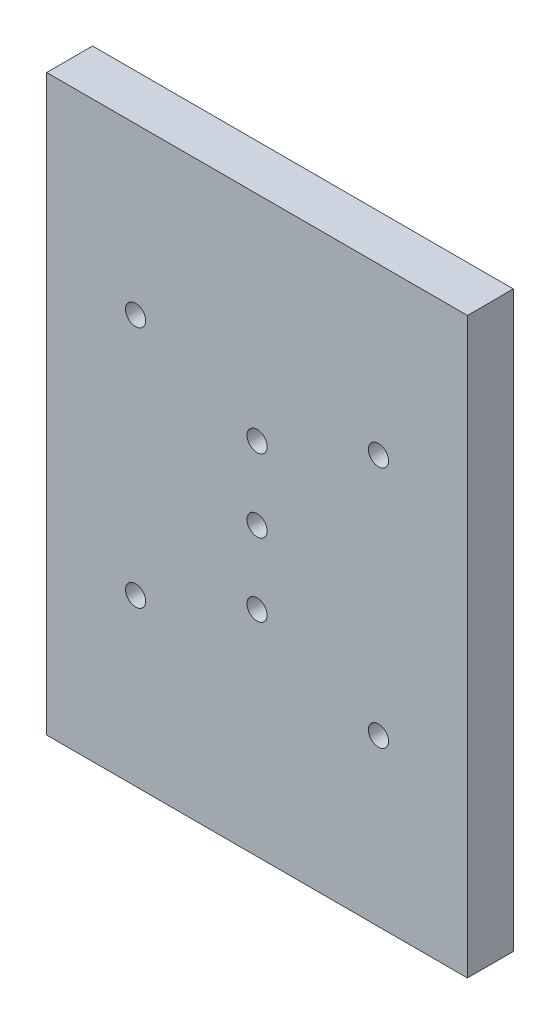
ISO-10303-21;
HEADER;
FILE_DESCRIPTION(('STEP AP214'),'2;1');
FILE_NAME('part.step','',(''),(''),'','','');
FILE_SCHEMA(('AUTOMOTIVE_DESIGN { 1 0 10303 214 1 1 1 1 }'));
ENDSEC;
DATA;
#1=APPLICATION_CONTEXT('core data for automotive mechanical design processes');
#2=APPLICATION_PROTOCOL_DEFINITION('international standard','automotive_design',2000,#1);
#3=PRODUCT_CONTEXT('',#1,'mechanical');
#4=PRODUCT('Part','Part','',(#3));
#5=PRODUCT_RELATED_PRODUCT_CATEGORY('part','',(#4));
#6=PRODUCT_DEFINITION_FORMATION('','',#4);
#7=PRODUCT_DEFINITION_CONTEXT('part definition',#1,'design');
#8=PRODUCT_DEFINITION('design','',#6,#7);
#9=PRODUCT_DEFINITION_SHAPE('','',#8);
#10=(LENGTH_UNIT() NAMED_UNIT(*) SI_UNIT(.MILLI.,.METRE.));
#11=(NAMED_UNIT(*) PLANE_ANGLE_UNIT() SI_UNIT($,.RADIAN.));
#12=(NAMED_UNIT(*) SI_UNIT($,.STERADIAN.) SOLID_ANGLE_UNIT());
#13=UNCERTAINTY_MEASURE_WITH_UNIT(LENGTH_MEASURE(1.E-05),#10,'distance_accuracy_value','');
#14=(GEOMETRIC_REPRESENTATION_CONTEXT(3) GLOBAL_UNCERTAINTY_ASSIGNED_CONTEXT((#13)) GLOBAL_UNIT_ASSIGNED_CONTEXT((#10,
#11,#12)) REPRESENTATION_CONTEXT('',''));
#15=CARTESIAN_POINT('',(0.,0.,0.));
#16=DIRECTION('',(0.,0.,1.));
#17=DIRECTION('',(1.,0.,0.));
#18=AXIS2_PLACEMENT_3D('',#15,#16,#17);
#19=CARTESIAN_POINT('',(-11.6249999999999,-53.3750000000001,6.));
#20=DIRECTION('',(0.,0.,-1.));
#21=DIRECTION('',(-1.,0.,0.));
#22=AXIS2_PLACEMENT_3D('',#19,#20,#21);
#23=CYLINDRICAL_SURFACE('',#22,1.32);
#24=CARTESIAN_POINT('',(-11.6249999999999,-53.3750000000001,6.));
#25=DIRECTION('',(0.,0.,1.));
#26=DIRECTION('',(1.,0.,0.));
#27=AXIS2_PLACEMENT_3D('',#24,#25,#26);
#28=CIRCLE('',#27,1.32);
#29=CARTESIAN_POINT('',(-10.3049999999999,-53.3750000000001,6.));
#30=VERTEX_POINT('',#29);
#31=EDGE_CURVE('E160',#30,#30,#28,.T.);
#32=ORIENTED_EDGE('',*,*,#31,.T.);
#33=EDGE_LOOP('',(#32));
#34=FACE_BOUND('',#33,.T.);
#35=CARTESIAN_POINT('',(-11.6249999999999,-53.3750000000001,4.));
#36=DIRECTION('',(0.,0.,-1.));
#37=DIRECTION('',(-1.,0.,0.));
#38=AXIS2_PLACEMENT_3D('',#35,#36,#37);
#39=CIRCLE('',#38,1.32);
#40=CARTESIAN_POINT('',(-12.9449999999999,-53.3750000000001,4.));
#41=VERTEX_POINT('',#40);
#42=EDGE_CURVE('E39',#41,#41,#39,.T.);
#43=ORIENTED_EDGE('',*,*,#42,.T.);
#44=EDGE_LOOP('',(#43));
#45=FACE_BOUND('',#44,.T.);
#46=ADVANCED_FACE('F35',(#34,#45),#23,.F.);
#47=CARTESIAN_POINT('',(-43.3750000000002,-53.3750000000001,6.));
#48=DIRECTION('',(0.,0.,-1.));
#49=DIRECTION('',(-1.,0.,0.));
#50=AXIS2_PLACEMENT_3D('',#47,#48,#49);
#51=CYLINDRICAL_SURFACE('',#50,1.32);
#52=CARTESIAN_POINT('',(-43.3750000000002,-53.3750000000001,6.));
#53=DIRECTION('',(0.,0.,1.));
#54=DIRECTION('',(1.,0.,0.));
#55=AXIS2_PLACEMENT_3D('',#52,#53,#54);
#56=CIRCLE('',#55,1.32);
#57=CARTESIAN_POINT('',(-42.0550000000002,-53.3750000000001,6.));
#58=VERTEX_POINT('',#57);
#59=EDGE_CURVE('E155',#58,#58,#56,.T.);
#60=ORIENTED_EDGE('',*,*,#59,.T.);
#61=EDGE_LOOP('',(#60));
#62=FACE_BOUND('',#61,.T.);
#63=CARTESIAN_POINT('',(-43.3750000000002,-53.3750000000001,4.));
#64=DIRECTION('',(0.,0.,-1.));
#65=DIRECTION('',(-1.,0.,0.));
#66=AXIS2_PLACEMENT_3D('',#63,#64,#65);
#67=CIRCLE('',#66,1.32);
#68=CARTESIAN_POINT('',(-44.6950000000002,-53.3750000000001,4.));
#69=VERTEX_POINT('',#68);
#70=EDGE_CURVE('E121',#69,#69,#67,.T.);
#71=ORIENTED_EDGE('',*,*,#70,.T.);
#72=EDGE_LOOP('',(#71));
#73=FACE_BOUND('',#72,.T.);
#74=ADVANCED_FACE('F208',(#62,#73),#51,.F.);
#75=CARTESIAN_POINT('',(-43.3750000000002,-21.6250000000001,6.));
#76=DIRECTION('',(0.,0.,-1.));
#77=DIRECTION('',(-1.,0.,0.));
#78=AXIS2_PLACEMENT_3D('',#75,#76,#77);
#79=CYLINDRICAL_SURFACE('',#78,1.32);
#80=CARTESIAN_POINT('',(-43.3750000000002,-21.6250000000001,6.));
#81=DIRECTION('',(0.,0.,1.));
#82=DIRECTION('',(1.,0.,0.));
#83=AXIS2_PLACEMENT_3D('',#80,#81,#82);
#84=CIRCLE('',#83,1.32);
#85=CARTESIAN_POINT('',(-42.0550000000002,-21.6250000000001,6.));
#86=VERTEX_POINT('',#85);
#87=EDGE_CURVE('E106',#86,#86,#84,.T.);
#88=ORIENTED_EDGE('',*,*,#87,.T.);
#89=EDGE_LOOP('',(#88));
#90=FACE_BOUND('',#89,.T.);
#91=CARTESIAN_POINT('',(-43.3750000000002,-21.6250000000001,4.));
#92=DIRECTION('',(0.,0.,-1.));
#93=DIRECTION('',(-1.,0.,0.));
#94=AXIS2_PLACEMENT_3D('',#91,#92,#93);
#95=CIRCLE('',#94,1.32);
#96=CARTESIAN_POINT('',(-44.6950000000002,-21.6250000000001,4.));
#97=VERTEX_POINT('',#96);
#98=EDGE_CURVE('E117',#97,#97,#95,.T.);
#99=ORIENTED_EDGE('',*,*,#98,.T.);
#100=EDGE_LOOP('',(#99));
#101=FACE_BOUND('',#100,.T.);
#102=ADVANCED_FACE('F175',(#90,#101),#79,.F.);
#103=CARTESIAN_POINT('',(-11.6250000000002,-21.6250000000001,6.));
#104=DIRECTION('',(0.,0.,-1.));
#105=DIRECTION('',(-1.,0.,0.));
#106=AXIS2_PLACEMENT_3D('',#103,#104,#105);
#107=CYLINDRICAL_SURFACE('',#106,1.32);
#108=CARTESIAN_POINT('',(-11.6250000000002,-21.6250000000001,6.));
#109=DIRECTION('',(0.,0.,1.));
#110=DIRECTION('',(1.,0.,0.));
#111=AXIS2_PLACEMENT_3D('',#108,#109,#110);
#112=CIRCLE('',#111,1.32);
#113=CARTESIAN_POINT('',(-10.3050000000002,-21.6250000000001,6.));
#114=VERTEX_POINT('',#113);
#115=EDGE_CURVE('E163',#114,#114,#112,.T.);
#116=ORIENTED_EDGE('',*,*,#115,.T.);
#117=EDGE_LOOP('',(#116));
#118=FACE_BOUND('',#117,.T.);
#119=CARTESIAN_POINT('',(-11.6250000000002,-21.6250000000001,4.));
#120=DIRECTION('',(0.,0.,-1.));
#121=DIRECTION('',(-1.,0.,0.));
#122=AXIS2_PLACEMENT_3D('',#119,#120,#121);
#123=CIRCLE('',#122,1.32);
#124=CARTESIAN_POINT('',(-12.9450000000002,-21.6250000000001,4.));
#125=VERTEX_POINT('',#124);
#126=EDGE_CURVE('E112',#125,#125,#123,.T.);
#127=ORIENTED_EDGE('',*,*,#126,.T.);
#128=EDGE_LOOP('',(#127));
#129=FACE_BOUND('',#128,.T.);
#130=ADVANCED_FACE('F180',(#118,#129),#107,.F.);
#131=CARTESIAN_POINT('',(0.,0.,6.));
#132=DIRECTION('',(0.,0.,-1.));
#133=DIRECTION('',(-1.,0.,0.));
#134=AXIS2_PLACEMENT_3D('',#131,#132,#133);
#135=PLANE('',#134);
#136=CARTESIAN_POINT('',(-27.5,-37.5,6.));
#137=DIRECTION('',(0.,0.,1.));
#138=DIRECTION('',(1.,0.,0.));
#139=AXIS2_PLACEMENT_3D('',#136,#137,#138);
#140=CIRCLE('',#139,1.32);
#141=CARTESIAN_POINT('',(-26.18,-37.5,6.));
#142=VERTEX_POINT('',#141);
#143=EDGE_CURVE('E152',#142,#142,#140,.T.);
#144=ORIENTED_EDGE('',*,*,#143,.F.);
#145=EDGE_LOOP('',(#144));
#146=FACE_BOUND('',#145,.T.);
#147=ORIENTED_EDGE('',*,*,#31,.F.);
#148=EDGE_LOOP('',(#147));
#149=FACE_BOUND('',#148,.T.);
#150=CARTESIAN_POINT('',(-27.5,-27.97,6.));
#151=DIRECTION('',(0.,0.,1.));
#152=DIRECTION('',(1.,0.,0.));
#153=AXIS2_PLACEMENT_3D('',#150,#151,#152);
#154=CIRCLE('',#153,1.32);
#155=CARTESIAN_POINT('',(-26.18,-27.97,6.));
#156=VERTEX_POINT('',#155);
#157=EDGE_CURVE('E167',#156,#156,#154,.T.);
#158=ORIENTED_EDGE('',*,*,#157,.F.);
#159=EDGE_LOOP('',(#158));
#160=FACE_BOUND('',#159,.T.);
#161=DIRECTION('',(0.,1.,0.));
#162=VECTOR('',#161,1.);
#163=CARTESIAN_POINT('',(0.,0.,6.));
#164=LINE('',#163,#162);
#165=CARTESIAN_POINT('',(0.,-75.,6.));
#166=VERTEX_POINT('',#165);
#167=CARTESIAN_POINT('',(0.,0.,6.));
#168=VERTEX_POINT('',#167);
#169=EDGE_CURVE('E90',#166,#168,#164,.T.);
#170=ORIENTED_EDGE('',*,*,#169,.T.);
#171=DIRECTION('',(-1.,0.,0.));
#172=VECTOR('',#171,1.);
#173=CARTESIAN_POINT('',(0.,0.,6.));
#174=LINE('',#173,#172);
#175=CARTESIAN_POINT('',(-55.,0.,6.));
#176=VERTEX_POINT('',#175);
#177=EDGE_CURVE('E84',#168,#176,#174,.T.);
#178=ORIENTED_EDGE('',*,*,#177,.T.);
#179=DIRECTION('',(0.,-1.,0.));
#180=VECTOR('',#179,1.);
#181=CARTESIAN_POINT('',(-55.,0.,6.));
#182=LINE('',#181,#180);
#183=CARTESIAN_POINT('',(-55.,-75.,6.));
#184=VERTEX_POINT('',#183);
#185=EDGE_CURVE('E88',#176,#184,#182,.T.);
#186=ORIENTED_EDGE('',*,*,#185,.T.);
#187=DIRECTION('',(1.,0.,0.));
#188=VECTOR('',#187,1.);
#189=CARTESIAN_POINT('',(0.,-75.,6.));
#190=LINE('',#189,#188);
#191=EDGE_CURVE('E54',#184,#166,#190,.T.);
#192=ORIENTED_EDGE('',*,*,#191,.T.);
#193=EDGE_LOOP('',(#170,#178,#186,#192));
#194=FACE_BOUND('',#193,.T.);
#195=ORIENTED_EDGE('',*,*,#87,.F.);
#196=EDGE_LOOP('',(#195));
#197=FACE_BOUND('',#196,.T.);
#198=ORIENTED_EDGE('',*,*,#115,.F.);
#199=EDGE_LOOP('',(#198));
#200=FACE_BOUND('',#199,.T.);
#201=ORIENTED_EDGE('',*,*,#59,.F.);
#202=EDGE_LOOP('',(#201));
#203=FACE_BOUND('',#202,.T.);
#204=CARTESIAN_POINT('',(-27.5,-47.03,6.));
#205=DIRECTION('',(0.,0.,1.));
#206=DIRECTION('',(1.,0.,0.));
#207=AXIS2_PLACEMENT_3D('',#204,#205,#206);
#208=CIRCLE('',#207,1.32);
#209=CARTESIAN_POINT('',(-26.18,-47.03,6.));
#210=VERTEX_POINT('',#209);
#211=EDGE_CURVE('E146',#210,#210,#208,.T.);
#212=ORIENTED_EDGE('',*,*,#211,.F.);
#213=EDGE_LOOP('',(#212));
#214=FACE_BOUND('',#213,.T.);
#215=ADVANCED_FACE('F85',(#146,#149,#160,#194,#197,#200,#203,#214),#135,.F.);
#216=CARTESIAN_POINT('',(0.,0.,0.));
#217=DIRECTION('',(0.,0.,-1.));
#218=DIRECTION('',(-1.,0.,0.));
#219=AXIS2_PLACEMENT_3D('',#216,#217,#218);
#220=PLANE('',#219);
#221=CARTESIAN_POINT('',(-11.6250000000006,-53.3750000000001,0.));
#222=DIRECTION('',(0.,0.,-1.));
#223=DIRECTION('',(-1.,0.,0.));
#224=AXIS2_PLACEMENT_3D('',#221,#222,#223);
#225=CIRCLE('',#224,3.25);
#226=CARTESIAN_POINT('',(-14.8750000000006,-53.3750000000001,0.));
#227=VERTEX_POINT('',#226);
#228=EDGE_CURVE('E137',#227,#227,#225,.T.);
#229=ORIENTED_EDGE('',*,*,#228,.F.);
#230=EDGE_LOOP('',(#229));
#231=FACE_BOUND('',#230,.T.);
#232=CARTESIAN_POINT('',(-43.3750000000006,-53.3750000000001,0.));
#233=DIRECTION('',(0.,0.,-1.));
#234=DIRECTION('',(-1.,0.,0.));
#235=AXIS2_PLACEMENT_3D('',#232,#233,#234);
#236=CIRCLE('',#235,3.25000000000001);
#237=CARTESIAN_POINT('',(-46.6250000000006,-53.3750000000001,0.));
#238=VERTEX_POINT('',#237);
#239=EDGE_CURVE('E130',#238,#238,#236,.T.);
#240=ORIENTED_EDGE('',*,*,#239,.F.);
#241=EDGE_LOOP('',(#240));
#242=FACE_BOUND('',#241,.T.);
#243=CARTESIAN_POINT('',(-43.3750000000002,-21.6250000000001,0.));
#244=DIRECTION('',(0.,0.,-1.));
#245=DIRECTION('',(-1.,0.,0.));
#246=AXIS2_PLACEMENT_3D('',#243,#244,#245);
#247=CIRCLE('',#246,3.25000000000001);
#248=CARTESIAN_POINT('',(-46.6250000000002,-21.6250000000001,0.));
#249=VERTEX_POINT('',#248);
#250=EDGE_CURVE('E123',#249,#249,#247,.T.);
#251=ORIENTED_EDGE('',*,*,#250,.F.);
#252=EDGE_LOOP('',(#251));
#253=FACE_BOUND('',#252,.T.);
#254=CARTESIAN_POINT('',(-11.6250000000002,-21.6250000000001,0.));
#255=DIRECTION('',(0.,0.,-1.));
#256=DIRECTION('',(-1.,0.,0.));
#257=AXIS2_PLACEMENT_3D('',#254,#255,#256);
#258=CIRCLE('',#257,3.25);
#259=CARTESIAN_POINT('',(-14.8750000000002,-21.6250000000001,0.));
#260=VERTEX_POINT('',#259);
#261=EDGE_CURVE('E119',#260,#260,#258,.T.);
#262=ORIENTED_EDGE('',*,*,#261,.F.);
#263=EDGE_LOOP('',(#262));
#264=FACE_BOUND('',#263,.T.);
#265=CARTESIAN_POINT('',(-27.5,-37.5,0.));
#266=DIRECTION('',(0.,0.,1.));
#267=DIRECTION('',(1.,0.,0.));
#268=AXIS2_PLACEMENT_3D('',#265,#266,#267);
#269=CIRCLE('',#268,1.32);
#270=CARTESIAN_POINT('',(-26.18,-37.5,0.));
#271=VERTEX_POINT('',#270);
#272=EDGE_CURVE('E149',#271,#271,#269,.T.);
#273=ORIENTED_EDGE('',*,*,#272,.T.);
#274=EDGE_LOOP('',(#273));
#275=FACE_BOUND('',#274,.T.);
#276=CARTESIAN_POINT('',(-27.5,-27.97,0.));
#277=DIRECTION('',(0.,0.,1.));
#278=DIRECTION('',(1.,0.,0.));
#279=AXIS2_PLACEMENT_3D('',#276,#277,#278);
#280=CIRCLE('',#279,1.32);
#281=CARTESIAN_POINT('',(-26.18,-27.97,0.));
#282=VERTEX_POINT('',#281);
#283=EDGE_CURVE('E166',#282,#282,#280,.T.);
#284=ORIENTED_EDGE('',*,*,#283,.T.);
#285=EDGE_LOOP('',(#284));
#286=FACE_BOUND('',#285,.T.);
#287=DIRECTION('',(0.,1.,0.));
#288=VECTOR('',#287,1.);
#289=CARTESIAN_POINT('',(0.,0.,0.));
#290=LINE('',#289,#288);
#291=CARTESIAN_POINT('',(0.,-75.,0.));
#292=VERTEX_POINT('',#291);
#293=CARTESIAN_POINT('',(0.,0.,0.));
#294=VERTEX_POINT('',#293);
#295=EDGE_CURVE('E103',#292,#294,#290,.T.);
#296=ORIENTED_EDGE('',*,*,#295,.F.);
#297=DIRECTION('',(1.,0.,0.));
#298=VECTOR('',#297,1.);
#299=CARTESIAN_POINT('',(0.,-75.,0.));
#300=LINE('',#299,#298);
#301=CARTESIAN_POINT('',(-55.,-75.,0.));
#302=VERTEX_POINT('',#301);
#303=EDGE_CURVE('E77',#302,#292,#300,.T.);
#304=ORIENTED_EDGE('',*,*,#303,.F.);
#305=DIRECTION('',(0.,-1.,0.));
#306=VECTOR('',#305,1.);
#307=CARTESIAN_POINT('',(-55.,0.,0.));
#308=LINE('',#307,#306);
#309=CARTESIAN_POINT('',(-55.,0.,0.));
#310=VERTEX_POINT('',#309);
#311=EDGE_CURVE('E71',#310,#302,#308,.T.);
#312=ORIENTED_EDGE('',*,*,#311,.F.);
#313=DIRECTION('',(-1.,0.,0.));
#314=VECTOR('',#313,1.);
#315=CARTESIAN_POINT('',(0.,0.,0.));
#316=LINE('',#315,#314);
#317=EDGE_CURVE('E94',#294,#310,#316,.T.);
#318=ORIENTED_EDGE('',*,*,#317,.F.);
#319=EDGE_LOOP('',(#296,#304,#312,#318));
#320=FACE_BOUND('',#319,.T.);
#321=CARTESIAN_POINT('',(-27.5,-47.03,0.));
#322=DIRECTION('',(0.,0.,1.));
#323=DIRECTION('',(1.,0.,0.));
#324=AXIS2_PLACEMENT_3D('',#321,#322,#323);
#325=CIRCLE('',#324,1.32);
#326=CARTESIAN_POINT('',(-26.18,-47.03,0.));
#327=VERTEX_POINT('',#326);
#328=EDGE_CURVE('E115',#327,#327,#325,.T.);
#329=ORIENTED_EDGE('',*,*,#328,.T.);
#330=EDGE_LOOP('',(#329));
#331=FACE_BOUND('',#330,.T.);
#332=ADVANCED_FACE('F179',(#231,#242,#253,#264,#275,#286,#320,#331),#220,.T.);
#333=CARTESIAN_POINT('',(0.,0.,6.));
#334=DIRECTION('',(-1.,0.,0.));
#335=DIRECTION('',(0.,-1.,0.));
#336=AXIS2_PLACEMENT_3D('',#333,#334,#335);
#337=PLANE('',#336);
#338=ORIENTED_EDGE('',*,*,#295,.T.);
#339=DIRECTION('',(0.,0.,-1.));
#340=VECTOR('',#339,1.);
#341=CARTESIAN_POINT('',(0.,0.,6.));
#342=LINE('',#341,#340);
#343=EDGE_CURVE('E11',#168,#294,#342,.T.);
#344=ORIENTED_EDGE('',*,*,#343,.F.);
#345=ORIENTED_EDGE('',*,*,#169,.F.);
#346=DIRECTION('',(0.,0.,-1.));
#347=VECTOR('',#346,1.);
#348=CARTESIAN_POINT('',(0.,-75.,6.));
#349=LINE('',#348,#347);
#350=EDGE_CURVE('E99',#166,#292,#349,.T.);
#351=ORIENTED_EDGE('',*,*,#350,.T.);
#352=EDGE_LOOP('',(#338,#344,#345,#351));
#353=FACE_BOUND('',#352,.T.);
#354=ADVANCED_FACE('F37',(#353),#337,.F.);
#355=CARTESIAN_POINT('',(0.,0.,6.));
#356=DIRECTION('',(0.,-1.,0.));
#357=DIRECTION('',(1.,0.,0.));
#358=AXIS2_PLACEMENT_3D('',#355,#356,#357);
#359=PLANE('',#358);
#360=ORIENTED_EDGE('',*,*,#317,.T.);
#361=DIRECTION('',(0.,0.,-1.));
#362=VECTOR('',#361,1.);
#363=CARTESIAN_POINT('',(-55.,0.,6.));
#364=LINE('',#363,#362);
#365=EDGE_CURVE('E45',#176,#310,#364,.T.);
#366=ORIENTED_EDGE('',*,*,#365,.F.);
#367=ORIENTED_EDGE('',*,*,#177,.F.);
#368=ORIENTED_EDGE('',*,*,#343,.T.);
#369=EDGE_LOOP('',(#360,#366,#367,#368));
#370=FACE_BOUND('',#369,.T.);
#371=ADVANCED_FACE('F93',(#370),#359,.F.);
#372=CARTESIAN_POINT('',(-55.,0.,6.));
#373=DIRECTION('',(1.,0.,0.));
#374=DIRECTION('',(0.,1.,0.));
#375=AXIS2_PLACEMENT_3D('',#372,#373,#374);
#376=PLANE('',#375);
#377=ORIENTED_EDGE('',*,*,#311,.T.);
#378=DIRECTION('',(0.,0.,-1.));
#379=VECTOR('',#378,1.);
#380=CARTESIAN_POINT('',(-55.,-75.,6.));
#381=LINE('',#380,#379);
#382=EDGE_CURVE('E95',#184,#302,#381,.T.);
#383=ORIENTED_EDGE('',*,*,#382,.F.);
#384=ORIENTED_EDGE('',*,*,#185,.F.);
#385=ORIENTED_EDGE('',*,*,#365,.T.);
#386=EDGE_LOOP('',(#377,#383,#384,#385));
#387=FACE_BOUND('',#386,.T.);
#388=ADVANCED_FACE('F97',(#387),#376,.F.);
#389=CARTESIAN_POINT('',(0.,-75.,6.));
#390=DIRECTION('',(0.,1.,0.));
#391=DIRECTION('',(-1.,0.,0.));
#392=AXIS2_PLACEMENT_3D('',#389,#390,#391);
#393=PLANE('',#392);
#394=ORIENTED_EDGE('',*,*,#303,.T.);
#395=ORIENTED_EDGE('',*,*,#350,.F.);
#396=ORIENTED_EDGE('',*,*,#191,.F.);
#397=ORIENTED_EDGE('',*,*,#382,.T.);
#398=EDGE_LOOP('',(#394,#395,#396,#397));
#399=FACE_BOUND('',#398,.T.);
#400=ADVANCED_FACE('F225',(#399),#393,.F.);
#401=CARTESIAN_POINT('',(-27.5,-27.97,6.));
#402=DIRECTION('',(0.,0.,-1.));
#403=DIRECTION('',(-1.,0.,0.));
#404=AXIS2_PLACEMENT_3D('',#401,#402,#403);
#405=CYLINDRICAL_SURFACE('',#404,1.32);
#406=ORIENTED_EDGE('',*,*,#157,.T.);
#407=EDGE_LOOP('',(#406));
#408=FACE_BOUND('',#407,.T.);
#409=ORIENTED_EDGE('',*,*,#283,.F.);
#410=EDGE_LOOP('',(#409));
#411=FACE_BOUND('',#410,.T.);
#412=ADVANCED_FACE('F222',(#408,#411),#405,.F.);
#413=CARTESIAN_POINT('',(-27.5,-37.5,6.));
#414=DIRECTION('',(0.,0.,-1.));
#415=DIRECTION('',(-1.,0.,0.));
#416=AXIS2_PLACEMENT_3D('',#413,#414,#415);
#417=CYLINDRICAL_SURFACE('',#416,1.32);
#418=ORIENTED_EDGE('',*,*,#143,.T.);
#419=EDGE_LOOP('',(#418));
#420=FACE_BOUND('',#419,.T.);
#421=ORIENTED_EDGE('',*,*,#272,.F.);
#422=EDGE_LOOP('',(#421));
#423=FACE_BOUND('',#422,.T.);
#424=ADVANCED_FACE('F193',(#420,#423),#417,.F.);
#425=CARTESIAN_POINT('',(-27.5,-47.03,6.));
#426=DIRECTION('',(0.,0.,-1.));
#427=DIRECTION('',(-1.,0.,0.));
#428=AXIS2_PLACEMENT_3D('',#425,#426,#427);
#429=CYLINDRICAL_SURFACE('',#428,1.32);
#430=ORIENTED_EDGE('',*,*,#211,.T.);
#431=EDGE_LOOP('',(#430));
#432=FACE_BOUND('',#431,.T.);
#433=ORIENTED_EDGE('',*,*,#328,.F.);
#434=EDGE_LOOP('',(#433));
#435=FACE_BOUND('',#434,.T.);
#436=ADVANCED_FACE('F189',(#432,#435),#429,.F.);
#437=CARTESIAN_POINT('',(-11.6250000000002,-21.6250000000001,4.));
#438=DIRECTION('',(0.,0.,-1.));
#439=DIRECTION('',(-1.,0.,0.));
#440=AXIS2_PLACEMENT_3D('',#437,#438,#439);
#441=CYLINDRICAL_SURFACE('',#440,3.25);
#442=CARTESIAN_POINT('',(-11.6250000000002,-21.6250000000001,4.));
#443=DIRECTION('',(0.,0.,-1.));
#444=DIRECTION('',(-1.,0.,0.));
#445=AXIS2_PLACEMENT_3D('',#442,#443,#444);
#446=CIRCLE('',#445,3.25);
#447=CARTESIAN_POINT('',(-14.8750000000002,-21.6250000000001,4.));
#448=VERTEX_POINT('',#447);
#449=EDGE_CURVE('E116',#448,#448,#446,.T.);
#450=ORIENTED_EDGE('',*,*,#449,.F.);
#451=EDGE_LOOP('',(#450));
#452=FACE_BOUND('',#451,.T.);
#453=ORIENTED_EDGE('',*,*,#261,.T.);
#454=EDGE_LOOP('',(#453));
#455=FACE_BOUND('',#454,.T.);
#456=ADVANCED_FACE('F192',(#452,#455),#441,.F.);
#457=CARTESIAN_POINT('',(-11.6250000000002,-21.6250000000001,4.));
#458=DIRECTION('',(0.,0.,-1.));
#459=DIRECTION('',(-1.,0.,0.));
#460=AXIS2_PLACEMENT_3D('',#457,#458,#459);
#461=PLANE('',#460);
#462=ORIENTED_EDGE('',*,*,#126,.F.);
#463=EDGE_LOOP('',(#462));
#464=FACE_BOUND('',#463,.T.);
#465=ORIENTED_EDGE('',*,*,#449,.T.);
#466=EDGE_LOOP('',(#465));
#467=FACE_BOUND('',#466,.T.);
#468=ADVANCED_FACE('F313',(#464,#467),#461,.T.);
#469=CARTESIAN_POINT('',(-43.3750000000002,-21.6250000000001,4.));
#470=DIRECTION('',(0.,0.,-1.));
#471=DIRECTION('',(-1.,0.,0.));
#472=AXIS2_PLACEMENT_3D('',#469,#470,#471);
#473=CYLINDRICAL_SURFACE('',#472,3.25000000000001);
#474=CARTESIAN_POINT('',(-43.3750000000002,-21.6250000000001,4.));
#475=DIRECTION('',(0.,0.,-1.));
#476=DIRECTION('',(-1.,0.,0.));
#477=AXIS2_PLACEMENT_3D('',#474,#475,#476);
#478=CIRCLE('',#477,3.25000000000001);
#479=CARTESIAN_POINT('',(-46.6250000000002,-21.6250000000001,4.));
#480=VERTEX_POINT('',#479);
#481=EDGE_CURVE('E120',#480,#480,#478,.T.);
#482=ORIENTED_EDGE('',*,*,#481,.F.);
#483=EDGE_LOOP('',(#482));
#484=FACE_BOUND('',#483,.T.);
#485=ORIENTED_EDGE('',*,*,#250,.T.);
#486=EDGE_LOOP('',(#485));
#487=FACE_BOUND('',#486,.T.);
#488=ADVANCED_FACE('F322',(#484,#487),#473,.F.);
#489=CARTESIAN_POINT('',(-43.3750000000002,-21.6250000000001,4.));
#490=DIRECTION('',(0.,0.,-1.));
#491=DIRECTION('',(-1.,0.,0.));
#492=AXIS2_PLACEMENT_3D('',#489,#490,#491);
#493=PLANE('',#492);
#494=ORIENTED_EDGE('',*,*,#98,.F.);
#495=EDGE_LOOP('',(#494));
#496=FACE_BOUND('',#495,.T.);
#497=ORIENTED_EDGE('',*,*,#481,.T.);
#498=EDGE_LOOP('',(#497));
#499=FACE_BOUND('',#498,.T.);
#500=ADVANCED_FACE('F331',(#496,#499),#493,.T.);
#501=CARTESIAN_POINT('',(-43.3750000000006,-53.3750000000001,4.));
#502=DIRECTION('',(0.,0.,-1.));
#503=DIRECTION('',(-1.,0.,0.));
#504=AXIS2_PLACEMENT_3D('',#501,#502,#503);
#505=CYLINDRICAL_SURFACE('',#504,3.25000000000001);
#506=CARTESIAN_POINT('',(-43.3750000000006,-53.3750000000001,4.));
#507=DIRECTION('',(0.,0.,-1.));
#508=DIRECTION('',(-1.,0.,0.));
#509=AXIS2_PLACEMENT_3D('',#506,#507,#508);
#510=CIRCLE('',#509,3.25000000000001);
#511=CARTESIAN_POINT('',(-46.6250000000006,-53.3750000000001,4.));
#512=VERTEX_POINT('',#511);
#513=EDGE_CURVE('E124',#512,#512,#510,.T.);
#514=ORIENTED_EDGE('',*,*,#513,.F.);
#515=EDGE_LOOP('',(#514));
#516=FACE_BOUND('',#515,.T.);
#517=ORIENTED_EDGE('',*,*,#239,.T.);
#518=EDGE_LOOP('',(#517));
#519=FACE_BOUND('',#518,.T.);
#520=ADVANCED_FACE('F340',(#516,#519),#505,.F.);
#521=CARTESIAN_POINT('',(-43.3750000000006,-53.3750000000001,4.));
#522=DIRECTION('',(0.,0.,-1.));
#523=DIRECTION('',(-1.,0.,0.));
#524=AXIS2_PLACEMENT_3D('',#521,#522,#523);
#525=PLANE('',#524);
#526=ORIENTED_EDGE('',*,*,#70,.F.);
#527=EDGE_LOOP('',(#526));
#528=FACE_BOUND('',#527,.T.);
#529=ORIENTED_EDGE('',*,*,#513,.T.);
#530=EDGE_LOOP('',(#529));
#531=FACE_BOUND('',#530,.T.);
#532=ADVANCED_FACE('F349',(#528,#531),#525,.T.);
#533=CARTESIAN_POINT('',(-11.6250000000006,-53.3750000000001,4.));
#534=DIRECTION('',(0.,0.,-1.));
#535=DIRECTION('',(-1.,0.,0.));
#536=AXIS2_PLACEMENT_3D('',#533,#534,#535);
#537=CYLINDRICAL_SURFACE('',#536,3.25);
#538=CARTESIAN_POINT('',(-11.6250000000006,-53.3750000000001,4.));
#539=DIRECTION('',(0.,0.,-1.));
#540=DIRECTION('',(-1.,0.,0.));
#541=AXIS2_PLACEMENT_3D('',#538,#539,#540);
#542=CIRCLE('',#541,3.25);
#543=CARTESIAN_POINT('',(-14.8750000000006,-53.3750000000001,4.));
#544=VERTEX_POINT('',#543);
#545=EDGE_CURVE('E391',#544,#544,#542,.T.);
#546=ORIENTED_EDGE('',*,*,#545,.F.);
#547=EDGE_LOOP('',(#546));
#548=FACE_BOUND('',#547,.T.);
#549=ORIENTED_EDGE('',*,*,#228,.T.);
#550=EDGE_LOOP('',(#549));
#551=FACE_BOUND('',#550,.T.);
#552=ADVANCED_FACE('F358',(#548,#551),#537,.F.);
#553=CARTESIAN_POINT('',(-11.6250000000006,-53.3750000000001,4.));
#554=DIRECTION('',(0.,0.,-1.));
#555=DIRECTION('',(-1.,0.,0.));
#556=AXIS2_PLACEMENT_3D('',#553,#554,#555);
#557=PLANE('',#556);
#558=ORIENTED_EDGE('',*,*,#42,.F.);
#559=EDGE_LOOP('',(#558));
#560=FACE_BOUND('',#559,.T.);
#561=ORIENTED_EDGE('',*,*,#545,.T.);
#562=EDGE_LOOP('',(#561));
#563=FACE_BOUND('',#562,.T.);
#564=ADVANCED_FACE('F367',(#560,#563),#557,.T.);
#565=CLOSED_SHELL('',(#46,#74,#102,#130,#215,#332,#354,#371,#388,#400,#412,#424,#436,#456,#468,
#488,#500,#520,#532,#552,#564));
#566=MANIFOLD_SOLID_BREP('B2',#565);
#567=ADVANCED_BREP_SHAPE_REPRESENTATION('',(#18,#566),#14);
#568=SHAPE_DEFINITION_REPRESENTATION(#9,#567);
ENDSEC;
END-ISO-10303-21;
